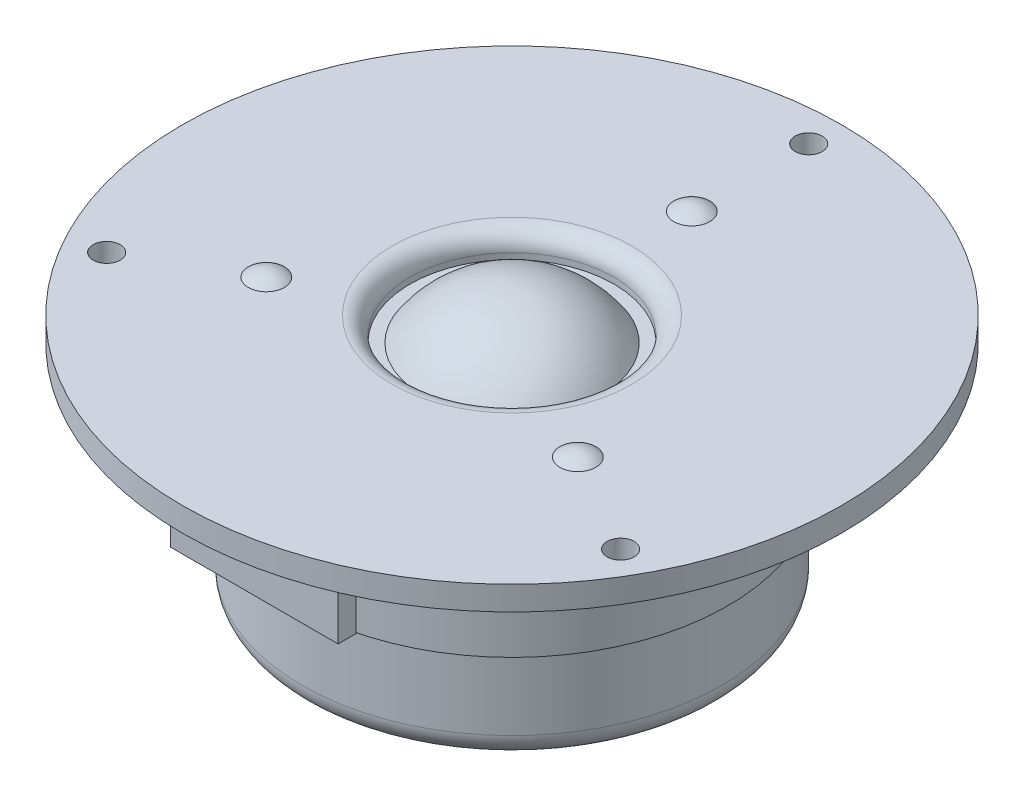
ISO-10303-21;
HEADER;
FILE_DESCRIPTION(('STEP AP214'),'2;1');
FILE_NAME('part.step','',(''),(''),'','','');
FILE_SCHEMA(('AUTOMOTIVE_DESIGN { 1 0 10303 214 1 1 1 1 }'));
ENDSEC;
DATA;
#1=APPLICATION_CONTEXT('core data for automotive mechanical design processes');
#2=APPLICATION_PROTOCOL_DEFINITION('international standard','automotive_design',2000,#1);
#3=PRODUCT_CONTEXT('',#1,'mechanical');
#4=PRODUCT('Part','Part','',(#3));
#5=PRODUCT_RELATED_PRODUCT_CATEGORY('part','',(#4));
#6=PRODUCT_DEFINITION_FORMATION('','',#4);
#7=PRODUCT_DEFINITION_CONTEXT('part definition',#1,'design');
#8=PRODUCT_DEFINITION('design','',#6,#7);
#9=PRODUCT_DEFINITION_SHAPE('','',#8);
#10=(LENGTH_UNIT() NAMED_UNIT(*) SI_UNIT(.MILLI.,.METRE.));
#11=(NAMED_UNIT(*) PLANE_ANGLE_UNIT() SI_UNIT($,.RADIAN.));
#12=(NAMED_UNIT(*) SI_UNIT($,.STERADIAN.) SOLID_ANGLE_UNIT());
#13=UNCERTAINTY_MEASURE_WITH_UNIT(LENGTH_MEASURE(1.E-05),#10,'distance_accuracy_value','');
#14=(GEOMETRIC_REPRESENTATION_CONTEXT(3) GLOBAL_UNCERTAINTY_ASSIGNED_CONTEXT((#13)) GLOBAL_UNIT_ASSIGNED_CONTEXT((#10,
#11,#12)) REPRESENTATION_CONTEXT('',''));
#15=CARTESIAN_POINT('',(0.,0.,0.));
#16=DIRECTION('',(0.,0.,1.));
#17=DIRECTION('',(1.,0.,0.));
#18=AXIS2_PLACEMENT_3D('',#15,#16,#17);
#19=CARTESIAN_POINT('',(37.,0.,0.));
#20=DIRECTION('',(0.,-1.,0.));
#21=DIRECTION('',(0.,0.,-1.));
#22=AXIS2_PLACEMENT_3D('',#19,#20,#21);
#23=PLANE('',#22);
#24=CARTESIAN_POINT('',(42.8682574873299,0.,24.7499999999996));
#25=DIRECTION('',(0.,-1.,0.));
#26=DIRECTION('',(0.,0.,-1.));
#27=AXIS2_PLACEMENT_3D('',#24,#25,#26);
#28=CIRCLE('',#27,2.25);
#29=CARTESIAN_POINT('',(42.8682574873299,0.,22.4999999999996));
#30=VERTEX_POINT('',#29);
#31=EDGE_CURVE('E121',#30,#30,#28,.T.);
#32=ORIENTED_EDGE('',*,*,#31,.F.);
#33=EDGE_LOOP('',(#32));
#34=FACE_BOUND('',#33,.T.);
#35=CARTESIAN_POINT('',(-42.8682574873296,0.,24.7500000000002));
#36=DIRECTION('',(0.,-1.,0.));
#37=DIRECTION('',(0.,0.,-1.));
#38=AXIS2_PLACEMENT_3D('',#35,#36,#37);
#39=CIRCLE('',#38,2.25);
#40=CARTESIAN_POINT('',(-42.8682574873296,0.,22.5000000000002));
#41=VERTEX_POINT('',#40);
#42=EDGE_CURVE('E127',#41,#41,#39,.T.);
#43=ORIENTED_EDGE('',*,*,#42,.F.);
#44=EDGE_LOOP('',(#43));
#45=FACE_BOUND('',#44,.T.);
#46=CARTESIAN_POINT('',(0.,0.,-49.5));
#47=DIRECTION('',(0.,-1.,0.));
#48=DIRECTION('',(0.,0.,-1.));
#49=AXIS2_PLACEMENT_3D('',#46,#47,#48);
#50=CIRCLE('',#49,2.25);
#51=CARTESIAN_POINT('',(0.,0.,-51.75));
#52=VERTEX_POINT('',#51);
#53=EDGE_CURVE('E136',#52,#52,#50,.T.);
#54=ORIENTED_EDGE('',*,*,#53,.F.);
#55=EDGE_LOOP('',(#54));
#56=FACE_BOUND('',#55,.T.);
#57=CARTESIAN_POINT('',(0.,0.,0.));
#58=DIRECTION('',(0.,-1.,0.));
#59=DIRECTION('',(0.,0.,-1.));
#60=AXIS2_PLACEMENT_3D('',#57,#58,#59);
#61=CIRCLE('',#60,55.);
#62=CARTESIAN_POINT('',(0.,0.,-55.));
#63=VERTEX_POINT('',#62);
#64=EDGE_CURVE('E148',#63,#63,#61,.T.);
#65=ORIENTED_EDGE('',*,*,#64,.T.);
#66=EDGE_LOOP('',(#65));
#67=FACE_BOUND('',#66,.T.);
#68=CARTESIAN_POINT('',(0.,0.,0.));
#69=DIRECTION('',(0.,-1.,0.));
#70=DIRECTION('',(0.,0.,-1.));
#71=AXIS2_PLACEMENT_3D('',#68,#69,#70);
#72=CIRCLE('',#71,37.);
#73=CARTESIAN_POINT('',(0.,0.,-37.));
#74=VERTEX_POINT('',#73);
#75=EDGE_CURVE('E151',#74,#74,#72,.T.);
#76=ORIENTED_EDGE('',*,*,#75,.F.);
#77=EDGE_LOOP('',(#76));
#78=FACE_BOUND('',#77,.T.);
#79=DIRECTION('',(1.,0.,0.));
#80=VECTOR('',#79,1.);
#81=CARTESIAN_POINT('',(-14.,0.,40.));
#82=LINE('',#81,#80);
#83=CARTESIAN_POINT('',(-14.,0.,40.));
#84=VERTEX_POINT('',#83);
#85=CARTESIAN_POINT('',(14.,0.,40.));
#86=VERTEX_POINT('',#85);
#87=EDGE_CURVE('E91',#84,#86,#82,.T.);
#88=ORIENTED_EDGE('',*,*,#87,.F.);
#89=DIRECTION('',(0.,0.,-1.));
#90=VECTOR('',#89,1.);
#91=CARTESIAN_POINT('',(-14.,0.,43.));
#92=LINE('',#91,#90);
#93=CARTESIAN_POINT('',(-14.,0.,43.));
#94=VERTEX_POINT('',#93);
#95=EDGE_CURVE('E102',#94,#84,#92,.T.);
#96=ORIENTED_EDGE('',*,*,#95,.F.);
#97=DIRECTION('',(-1.,0.,0.));
#98=VECTOR('',#97,1.);
#99=CARTESIAN_POINT('',(-14.,0.,43.));
#100=LINE('',#99,#98);
#101=CARTESIAN_POINT('',(14.,0.,43.));
#102=VERTEX_POINT('',#101);
#103=EDGE_CURVE('E72',#102,#94,#100,.T.);
#104=ORIENTED_EDGE('',*,*,#103,.F.);
#105=DIRECTION('',(0.,0.,1.));
#106=VECTOR('',#105,1.);
#107=CARTESIAN_POINT('',(14.,0.,43.));
#108=LINE('',#107,#106);
#109=EDGE_CURVE('E106',#86,#102,#108,.T.);
#110=ORIENTED_EDGE('',*,*,#109,.F.);
#111=EDGE_LOOP('',(#88,#96,#104,#110));
#112=FACE_BOUND('',#111,.T.);
#113=ADVANCED_FACE('F35',(#34,#45,#56,#67,#78,#112),#23,.T.);
#114=CARTESIAN_POINT('',(0.,-36.,0.));
#115=DIRECTION('',(0.,-1.,0.));
#116=DIRECTION('',(0.,0.,-1.));
#117=AXIS2_PLACEMENT_3D('',#114,#115,#116);
#118=PLANE('',#117);
#119=CARTESIAN_POINT('',(0.,-36.,0.));
#120=DIRECTION('',(0.,-1.,0.));
#121=DIRECTION('',(0.,0.,-1.));
#122=AXIS2_PLACEMENT_3D('',#119,#120,#121);
#123=CIRCLE('',#122,31.);
#124=CARTESIAN_POINT('',(0.,-36.,-31.));
#125=VERTEX_POINT('',#124);
#126=EDGE_CURVE('E172',#125,#125,#123,.T.);
#127=ORIENTED_EDGE('',*,*,#126,.T.);
#128=EDGE_LOOP('',(#127));
#129=FACE_BOUND('',#128,.T.);
#130=ADVANCED_FACE('F198',(#129),#118,.T.);
#131=CARTESIAN_POINT('',(0.,0.,0.));
#132=DIRECTION('',(0.,-1.,0.));
#133=DIRECTION('',(0.,0.,-1.));
#134=AXIS2_PLACEMENT_3D('',#131,#132,#133);
#135=CYLINDRICAL_SURFACE('',#134,35.);
#136=CARTESIAN_POINT('',(0.,-32.,0.));
#137=DIRECTION('',(0.,-1.,0.));
#138=DIRECTION('',(0.,0.,-1.));
#139=AXIS2_PLACEMENT_3D('',#136,#137,#138);
#140=CIRCLE('',#139,35.);
#141=CARTESIAN_POINT('',(0.,-32.,-35.));
#142=VERTEX_POINT('',#141);
#143=EDGE_CURVE('E175',#142,#142,#140,.F.);
#144=ORIENTED_EDGE('',*,*,#143,.T.);
#145=EDGE_LOOP('',(#144));
#146=FACE_BOUND('',#145,.T.);
#147=CARTESIAN_POINT('',(0.,-20.,0.));
#148=DIRECTION('',(0.,-1.,0.));
#149=DIRECTION('',(0.,0.,-1.));
#150=AXIS2_PLACEMENT_3D('',#147,#148,#149);
#151=CIRCLE('',#150,35.);
#152=CARTESIAN_POINT('',(0.,-20.,-35.));
#153=VERTEX_POINT('',#152);
#154=EDGE_CURVE('E169',#153,#153,#151,.T.);
#155=ORIENTED_EDGE('',*,*,#154,.T.);
#156=EDGE_LOOP('',(#155));
#157=FACE_BOUND('',#156,.T.);
#158=ADVANCED_FACE('F204',(#146,#157),#135,.T.);
#159=CARTESIAN_POINT('',(35.,-20.,0.));
#160=DIRECTION('',(0.,-1.,0.));
#161=DIRECTION('',(0.,0.,-1.));
#162=AXIS2_PLACEMENT_3D('',#159,#160,#161);
#163=PLANE('',#162);
#164=CARTESIAN_POINT('',(0.,-20.,0.));
#165=DIRECTION('',(0.,-1.,0.));
#166=DIRECTION('',(0.,0.,-1.));
#167=AXIS2_PLACEMENT_3D('',#164,#165,#166);
#168=CIRCLE('',#167,36.);
#169=CARTESIAN_POINT('',(0.,-20.,-36.));
#170=VERTEX_POINT('',#169);
#171=EDGE_CURVE('E166',#170,#170,#168,.T.);
#172=ORIENTED_EDGE('',*,*,#171,.T.);
#173=EDGE_LOOP('',(#172));
#174=FACE_BOUND('',#173,.T.);
#175=ORIENTED_EDGE('',*,*,#154,.F.);
#176=EDGE_LOOP('',(#175));
#177=FACE_BOUND('',#176,.T.);
#178=ADVANCED_FACE('F232',(#174,#177),#163,.T.);
#179=CARTESIAN_POINT('',(0.,0.,0.));
#180=DIRECTION('',(0.,-1.,0.));
#181=DIRECTION('',(0.,0.,-1.));
#182=AXIS2_PLACEMENT_3D('',#179,#180,#181);
#183=CYLINDRICAL_SURFACE('',#182,36.);
#184=CARTESIAN_POINT('',(0.,-8.,0.));
#185=DIRECTION('',(0.,-1.,0.));
#186=DIRECTION('',(0.,0.,-1.));
#187=AXIS2_PLACEMENT_3D('',#184,#185,#186);
#188=CIRCLE('',#187,36.);
#189=CARTESIAN_POINT('',(0.,-8.,-36.));
#190=VERTEX_POINT('',#189);
#191=EDGE_CURVE('E163',#190,#190,#188,.T.);
#192=ORIENTED_EDGE('',*,*,#191,.T.);
#193=EDGE_LOOP('',(#192));
#194=FACE_BOUND('',#193,.T.);
#195=ORIENTED_EDGE('',*,*,#171,.F.);
#196=EDGE_LOOP('',(#195));
#197=FACE_BOUND('',#196,.T.);
#198=ADVANCED_FACE('F228',(#194,#197),#183,.T.);
#199=CARTESIAN_POINT('',(36.,-8.,0.));
#200=DIRECTION('',(0.,1.,0.));
#201=DIRECTION('',(0.,0.,1.));
#202=AXIS2_PLACEMENT_3D('',#199,#200,#201);
#203=PLANE('',#202);
#204=CARTESIAN_POINT('',(0.,-8.,0.));
#205=DIRECTION('',(0.,-1.,0.));
#206=DIRECTION('',(0.,0.,-1.));
#207=AXIS2_PLACEMENT_3D('',#204,#205,#206);
#208=CIRCLE('',#207,35.);
#209=CARTESIAN_POINT('',(0.,-8.,-35.));
#210=VERTEX_POINT('',#209);
#211=EDGE_CURVE('E160',#210,#210,#208,.T.);
#212=ORIENTED_EDGE('',*,*,#211,.T.);
#213=EDGE_LOOP('',(#212));
#214=FACE_BOUND('',#213,.T.);
#215=ORIENTED_EDGE('',*,*,#191,.F.);
#216=EDGE_LOOP('',(#215));
#217=FACE_BOUND('',#216,.T.);
#218=ADVANCED_FACE('F224',(#214,#217),#203,.T.);
#219=CARTESIAN_POINT('',(0.,0.,0.));
#220=DIRECTION('',(0.,-1.,0.));
#221=DIRECTION('',(0.,0.,-1.));
#222=AXIS2_PLACEMENT_3D('',#219,#220,#221);
#223=CYLINDRICAL_SURFACE('',#222,35.);
#224=CARTESIAN_POINT('',(0.,-4.,0.));
#225=DIRECTION('',(0.,-1.,0.));
#226=DIRECTION('',(0.,0.,-1.));
#227=AXIS2_PLACEMENT_3D('',#224,#225,#226);
#228=CIRCLE('',#227,35.);
#229=CARTESIAN_POINT('',(0.,-4.,-35.));
#230=VERTEX_POINT('',#229);
#231=EDGE_CURVE('E157',#230,#230,#228,.T.);
#232=ORIENTED_EDGE('',*,*,#231,.T.);
#233=EDGE_LOOP('',(#232));
#234=FACE_BOUND('',#233,.T.);
#235=ORIENTED_EDGE('',*,*,#211,.F.);
#236=EDGE_LOOP('',(#235));
#237=FACE_BOUND('',#236,.T.);
#238=ADVANCED_FACE('F220',(#234,#237),#223,.T.);
#239=CARTESIAN_POINT('',(35.,-4.,0.));
#240=DIRECTION('',(0.,-1.,0.));
#241=DIRECTION('',(0.,0.,-1.));
#242=AXIS2_PLACEMENT_3D('',#239,#240,#241);
#243=PLANE('',#242);
#244=CARTESIAN_POINT('',(0.,-4.,0.));
#245=DIRECTION('',(0.,-1.,0.));
#246=DIRECTION('',(0.,0.,-1.));
#247=AXIS2_PLACEMENT_3D('',#244,#245,#246);
#248=CIRCLE('',#247,37.);
#249=CARTESIAN_POINT('',(0.,-4.,-37.));
#250=VERTEX_POINT('',#249);
#251=EDGE_CURVE('E154',#250,#250,#248,.T.);
#252=ORIENTED_EDGE('',*,*,#251,.T.);
#253=EDGE_LOOP('',(#252));
#254=FACE_BOUND('',#253,.T.);
#255=ORIENTED_EDGE('',*,*,#231,.F.);
#256=EDGE_LOOP('',(#255));
#257=FACE_BOUND('',#256,.T.);
#258=ADVANCED_FACE('F216',(#254,#257),#243,.T.);
#259=CARTESIAN_POINT('',(0.,0.,0.));
#260=DIRECTION('',(0.,-1.,0.));
#261=DIRECTION('',(0.,0.,-1.));
#262=AXIS2_PLACEMENT_3D('',#259,#260,#261);
#263=CYLINDRICAL_SURFACE('',#262,37.);
#264=ORIENTED_EDGE('',*,*,#75,.T.);
#265=EDGE_LOOP('',(#264));
#266=FACE_BOUND('',#265,.T.);
#267=ORIENTED_EDGE('',*,*,#251,.F.);
#268=EDGE_LOOP('',(#267));
#269=FACE_BOUND('',#268,.T.);
#270=ADVANCED_FACE('F213',(#266,#269),#263,.T.);
#271=CARTESIAN_POINT('',(0.,0.,0.));
#272=DIRECTION('',(0.,-1.,0.));
#273=DIRECTION('',(0.,0.,-1.));
#274=AXIS2_PLACEMENT_3D('',#271,#272,#273);
#275=CYLINDRICAL_SURFACE('',#274,55.);
#276=CARTESIAN_POINT('',(0.,4.,0.));
#277=DIRECTION('',(0.,-1.,0.));
#278=DIRECTION('',(0.,0.,-1.));
#279=AXIS2_PLACEMENT_3D('',#276,#277,#278);
#280=CIRCLE('',#279,55.);
#281=CARTESIAN_POINT('',(0.,4.,-55.));
#282=VERTEX_POINT('',#281);
#283=EDGE_CURVE('E145',#282,#282,#280,.T.);
#284=ORIENTED_EDGE('',*,*,#283,.T.);
#285=EDGE_LOOP('',(#284));
#286=FACE_BOUND('',#285,.T.);
#287=ORIENTED_EDGE('',*,*,#64,.F.);
#288=EDGE_LOOP('',(#287));
#289=FACE_BOUND('',#288,.T.);
#290=ADVANCED_FACE('F211',(#286,#289),#275,.T.);
#291=CARTESIAN_POINT('',(55.,4.,0.));
#292=DIRECTION('',(0.,1.,0.));
#293=DIRECTION('',(0.,0.,1.));
#294=AXIS2_PLACEMENT_3D('',#291,#292,#293);
#295=PLANE('',#294);
#296=CARTESIAN_POINT('',(25.9807621135333,4.,14.9999999999998));
#297=DIRECTION('',(0.,1.,0.));
#298=DIRECTION('',(-0.866025403784443,0.,-0.499999999999992));
#299=AXIS2_PLACEMENT_3D('',#296,#297,#298);
#300=CIRCLE('',#299,3.);
#301=CARTESIAN_POINT('',(23.38268590218,4.,13.4999999999998));
#302=VERTEX_POINT('',#301);
#303=EDGE_CURVE('E112',#302,#302,#300,.T.);
#304=ORIENTED_EDGE('',*,*,#303,.F.);
#305=EDGE_LOOP('',(#304));
#306=FACE_BOUND('',#305,.T.);
#307=CARTESIAN_POINT('',(-25.9807621135331,4.,15.0000000000001));
#308=DIRECTION('',(0.,1.,0.));
#309=DIRECTION('',(0.866025403784436,0.,-0.500000000000004));
#310=AXIS2_PLACEMENT_3D('',#307,#308,#309);
#311=CIRCLE('',#310,3.);
#312=CARTESIAN_POINT('',(-23.3826859021798,4.,13.5000000000001));
#313=VERTEX_POINT('',#312);
#314=EDGE_CURVE('E115',#313,#313,#311,.T.);
#315=ORIENTED_EDGE('',*,*,#314,.F.);
#316=EDGE_LOOP('',(#315));
#317=FACE_BOUND('',#316,.T.);
#318=CARTESIAN_POINT('',(42.8682574873299,4.,24.7499999999996));
#319=DIRECTION('',(0.,1.,0.));
#320=DIRECTION('',(0.,0.,1.));
#321=AXIS2_PLACEMENT_3D('',#318,#319,#320);
#322=CIRCLE('',#321,2.25);
#323=CARTESIAN_POINT('',(42.8682574873299,4.,26.9999999999996));
#324=VERTEX_POINT('',#323);
#325=EDGE_CURVE('E118',#324,#324,#322,.T.);
#326=ORIENTED_EDGE('',*,*,#325,.F.);
#327=EDGE_LOOP('',(#326));
#328=FACE_BOUND('',#327,.T.);
#329=CARTESIAN_POINT('',(-42.8682574873296,4.,24.7500000000002));
#330=DIRECTION('',(0.,1.,0.));
#331=DIRECTION('',(0.,0.,1.));
#332=AXIS2_PLACEMENT_3D('',#329,#330,#331);
#333=CIRCLE('',#332,2.25);
#334=CARTESIAN_POINT('',(-42.8682574873296,4.,27.0000000000002));
#335=VERTEX_POINT('',#334);
#336=EDGE_CURVE('E124',#335,#335,#333,.T.);
#337=ORIENTED_EDGE('',*,*,#336,.F.);
#338=EDGE_LOOP('',(#337));
#339=FACE_BOUND('',#338,.T.);
#340=CARTESIAN_POINT('',(0.,4.,-30.));
#341=DIRECTION('',(0.,1.,0.));
#342=DIRECTION('',(0.,0.,1.));
#343=AXIS2_PLACEMENT_3D('',#340,#341,#342);
#344=CIRCLE('',#343,3.);
#345=CARTESIAN_POINT('',(0.,4.,-27.));
#346=VERTEX_POINT('',#345);
#347=EDGE_CURVE('E130',#346,#346,#344,.T.);
#348=ORIENTED_EDGE('',*,*,#347,.F.);
#349=EDGE_LOOP('',(#348));
#350=FACE_BOUND('',#349,.T.);
#351=CARTESIAN_POINT('',(0.,4.,-49.5));
#352=DIRECTION('',(0.,1.,0.));
#353=DIRECTION('',(0.,0.,1.));
#354=AXIS2_PLACEMENT_3D('',#351,#352,#353);
#355=CIRCLE('',#354,2.25);
#356=CARTESIAN_POINT('',(0.,4.,-47.25));
#357=VERTEX_POINT('',#356);
#358=EDGE_CURVE('E133',#357,#357,#355,.T.);
#359=ORIENTED_EDGE('',*,*,#358,.F.);
#360=EDGE_LOOP('',(#359));
#361=FACE_BOUND('',#360,.T.);
#362=CARTESIAN_POINT('',(0.,4.,0.));
#363=DIRECTION('',(0.,1.,0.));
#364=DIRECTION('',(0.,0.,1.));
#365=AXIS2_PLACEMENT_3D('',#362,#363,#364);
#366=CIRCLE('',#365,20.);
#367=CARTESIAN_POINT('',(0.,4.,20.));
#368=VERTEX_POINT('',#367);
#369=EDGE_CURVE('E43',#368,#368,#366,.F.);
#370=ORIENTED_EDGE('',*,*,#369,.T.);
#371=EDGE_LOOP('',(#370));
#372=FACE_BOUND('',#371,.T.);
#373=ORIENTED_EDGE('',*,*,#283,.F.);
#374=EDGE_LOOP('',(#373));
#375=FACE_BOUND('',#374,.T.);
#376=ADVANCED_FACE('F180',(#306,#317,#328,#339,#350,#361,#372,#375),#295,.T.);
#377=CARTESIAN_POINT('',(0.,0.,0.));
#378=DIRECTION('',(0.,-1.,0.));
#379=DIRECTION('',(0.,0.,-1.));
#380=AXIS2_PLACEMENT_3D('',#377,#378,#379);
#381=CYLINDRICAL_SURFACE('',#380,17.);
#382=CARTESIAN_POINT('',(0.,0.999999999999998,0.));
#383=DIRECTION('',(0.,1.,0.));
#384=DIRECTION('',(0.,0.,1.));
#385=AXIS2_PLACEMENT_3D('',#382,#383,#384);
#386=CIRCLE('',#385,17.);
#387=CARTESIAN_POINT('',(0.,0.999999999999998,17.));
#388=VERTEX_POINT('',#387);
#389=EDGE_CURVE('E11',#388,#388,#386,.T.);
#390=ORIENTED_EDGE('',*,*,#389,.T.);
#391=EDGE_LOOP('',(#390));
#392=FACE_BOUND('',#391,.T.);
#393=CARTESIAN_POINT('',(0.,0.,0.));
#394=DIRECTION('',(0.,-1.,0.));
#395=DIRECTION('',(0.,0.,-1.));
#396=AXIS2_PLACEMENT_3D('',#393,#394,#395);
#397=CIRCLE('',#396,17.);
#398=CARTESIAN_POINT('',(0.,0.,-17.));
#399=VERTEX_POINT('',#398);
#400=EDGE_CURVE('E142',#399,#399,#397,.T.);
#401=ORIENTED_EDGE('',*,*,#400,.T.);
#402=EDGE_LOOP('',(#401));
#403=FACE_BOUND('',#402,.T.);
#404=ADVANCED_FACE('F287',(#392,#403),#381,.F.);
#405=CARTESIAN_POINT('',(17.,0.,0.));
#406=DIRECTION('',(0.,1.,0.));
#407=DIRECTION('',(0.,0.,1.));
#408=AXIS2_PLACEMENT_3D('',#405,#406,#407);
#409=PLANE('',#408);
#410=CARTESIAN_POINT('',(0.,0.,0.));
#411=DIRECTION('',(0.,-1.,0.));
#412=DIRECTION('',(0.,0.,-1.));
#413=AXIS2_PLACEMENT_3D('',#410,#411,#412);
#414=CIRCLE('',#413,15.);
#415=CARTESIAN_POINT('',(0.,0.,-15.));
#416=VERTEX_POINT('',#415);
#417=EDGE_CURVE('E139',#416,#416,#414,.T.);
#418=ORIENTED_EDGE('',*,*,#417,.T.);
#419=EDGE_LOOP('',(#418));
#420=FACE_BOUND('',#419,.T.);
#421=ORIENTED_EDGE('',*,*,#400,.F.);
#422=EDGE_LOOP('',(#421));
#423=FACE_BOUND('',#422,.T.);
#424=ADVANCED_FACE('F296',(#420,#423),#409,.T.);
#425=CARTESIAN_POINT('',(0.,-9.9498743710662,0.));
#426=DIRECTION('',(0.,-1.,0.));
#427=DIRECTION('',(1.,0.,0.));
#428=AXIS2_PLACEMENT_3D('',#425,#426,#427);
#429=SPHERICAL_SURFACE('',#428,18.);
#430=ORIENTED_EDGE('',*,*,#417,.F.);
#431=EDGE_LOOP('',(#430));
#432=FACE_BOUND('',#431,.T.);
#433=ADVANCED_FACE('F194',(#432),#429,.T.);
#434=CARTESIAN_POINT('',(0.,-32.,0.));
#435=DIRECTION('',(0.,-1.,0.));
#436=DIRECTION('',(0.,0.,-1.));
#437=AXIS2_PLACEMENT_3D('',#434,#435,#436);
#438=TOROIDAL_SURFACE('',#437,31.,4.);
#439=ORIENTED_EDGE('',*,*,#143,.F.);
#440=EDGE_LOOP('',(#439));
#441=FACE_BOUND('',#440,.T.);
#442=ORIENTED_EDGE('',*,*,#126,.F.);
#443=EDGE_LOOP('',(#442));
#444=FACE_BOUND('',#443,.T.);
#445=ADVANCED_FACE('F185',(#441,#444),#438,.T.);
#446=CARTESIAN_POINT('',(0.,0.999999999999998,0.));
#447=DIRECTION('',(0.,1.,0.));
#448=DIRECTION('',(0.,0.,1.));
#449=AXIS2_PLACEMENT_3D('',#446,#447,#448);
#450=TOROIDAL_SURFACE('',#449,20.,3.);
#451=ORIENTED_EDGE('',*,*,#389,.F.);
#452=EDGE_LOOP('',(#451));
#453=FACE_BOUND('',#452,.T.);
#454=ORIENTED_EDGE('',*,*,#369,.F.);
#455=EDGE_LOOP('',(#454));
#456=FACE_BOUND('',#455,.T.);
#457=ADVANCED_FACE('F37',(#453,#456),#450,.T.);
#458=CARTESIAN_POINT('',(0.,4.,-49.5));
#459=DIRECTION('',(0.,1.,0.));
#460=DIRECTION('',(0.,0.,1.));
#461=AXIS2_PLACEMENT_3D('',#458,#459,#460);
#462=CYLINDRICAL_SURFACE('',#461,2.25);
#463=ORIENTED_EDGE('',*,*,#53,.T.);
#464=EDGE_LOOP('',(#463));
#465=FACE_BOUND('',#464,.T.);
#466=ORIENTED_EDGE('',*,*,#358,.T.);
#467=EDGE_LOOP('',(#466));
#468=FACE_BOUND('',#467,.T.);
#469=ADVANCED_FACE('F184',(#465,#468),#462,.F.);
#470=CARTESIAN_POINT('',(0.,0.,-30.));
#471=DIRECTION('',(0.,1.,0.));
#472=DIRECTION('',(0.,0.,-1.));
#473=AXIS2_PLACEMENT_3D('',#470,#471,#472);
#474=SPHERICAL_SURFACE('',#473,5.00000000000001);
#475=ORIENTED_EDGE('',*,*,#347,.T.);
#476=EDGE_LOOP('',(#475));
#477=FACE_BOUND('',#476,.T.);
#478=ADVANCED_FACE('F191',(#477),#474,.T.);
#479=CARTESIAN_POINT('',(-42.8682574873296,4.,24.7500000000002));
#480=DIRECTION('',(0.,1.,0.));
#481=DIRECTION('',(0.,0.,1.));
#482=AXIS2_PLACEMENT_3D('',#479,#480,#481);
#483=CYLINDRICAL_SURFACE('',#482,2.25);
#484=ORIENTED_EDGE('',*,*,#42,.T.);
#485=EDGE_LOOP('',(#484));
#486=FACE_BOUND('',#485,.T.);
#487=ORIENTED_EDGE('',*,*,#336,.T.);
#488=EDGE_LOOP('',(#487));
#489=FACE_BOUND('',#488,.T.);
#490=ADVANCED_FACE('F334',(#486,#489),#483,.F.);
#491=CARTESIAN_POINT('',(42.8682574873299,4.,24.7499999999996));
#492=DIRECTION('',(0.,1.,0.));
#493=DIRECTION('',(0.,0.,1.));
#494=AXIS2_PLACEMENT_3D('',#491,#492,#493);
#495=CYLINDRICAL_SURFACE('',#494,2.25);
#496=ORIENTED_EDGE('',*,*,#31,.T.);
#497=EDGE_LOOP('',(#496));
#498=FACE_BOUND('',#497,.T.);
#499=ORIENTED_EDGE('',*,*,#325,.T.);
#500=EDGE_LOOP('',(#499));
#501=FACE_BOUND('',#500,.T.);
#502=ADVANCED_FACE('F342',(#498,#501),#495,.F.);
#503=CARTESIAN_POINT('',(-25.9807621135331,0.,15.0000000000001));
#504=DIRECTION('',(0.,1.,0.));
#505=DIRECTION('',(-0.866025403784436,0.,0.500000000000004));
#506=AXIS2_PLACEMENT_3D('',#503,#504,#505);
#507=SPHERICAL_SURFACE('',#506,5.00000000000001);
#508=ORIENTED_EDGE('',*,*,#314,.T.);
#509=EDGE_LOOP('',(#508));
#510=FACE_BOUND('',#509,.T.);
#511=ADVANCED_FACE('F351',(#510),#507,.T.);
#512=CARTESIAN_POINT('',(25.9807621135333,0.,14.9999999999998));
#513=DIRECTION('',(0.,1.,0.));
#514=DIRECTION('',(0.866025403784443,0.,0.499999999999992));
#515=AXIS2_PLACEMENT_3D('',#512,#513,#514);
#516=SPHERICAL_SURFACE('',#515,5.00000000000001);
#517=ORIENTED_EDGE('',*,*,#303,.T.);
#518=EDGE_LOOP('',(#517));
#519=FACE_BOUND('',#518,.T.);
#520=ADVANCED_FACE('F360',(#519),#516,.T.);
#521=CARTESIAN_POINT('',(-14.,-15.,43.));
#522=DIRECTION('',(1.,0.,0.));
#523=DIRECTION('',(0.,0.,-1.));
#524=AXIS2_PLACEMENT_3D('',#521,#522,#523);
#525=PLANE('',#524);
#526=ORIENTED_EDGE('',*,*,#95,.T.);
#527=DIRECTION('',(0.,1.,0.));
#528=VECTOR('',#527,1.);
#529=CARTESIAN_POINT('',(-14.,-15.,40.));
#530=LINE('',#529,#528);
#531=CARTESIAN_POINT('',(-14.,-15.,40.));
#532=VERTEX_POINT('',#531);
#533=EDGE_CURVE('E94',#532,#84,#530,.T.);
#534=ORIENTED_EDGE('',*,*,#533,.F.);
#535=DIRECTION('',(0.,0.,-1.));
#536=VECTOR('',#535,1.);
#537=CARTESIAN_POINT('',(-14.,-15.,43.));
#538=LINE('',#537,#536);
#539=CARTESIAN_POINT('',(-14.,-15.,43.));
#540=VERTEX_POINT('',#539);
#541=EDGE_CURVE('E84',#540,#532,#538,.T.);
#542=ORIENTED_EDGE('',*,*,#541,.F.);
#543=DIRECTION('',(0.,1.,0.));
#544=VECTOR('',#543,1.);
#545=CARTESIAN_POINT('',(-14.,-15.,43.));
#546=LINE('',#545,#544);
#547=EDGE_CURVE('E98',#540,#94,#546,.T.);
#548=ORIENTED_EDGE('',*,*,#547,.T.);
#549=EDGE_LOOP('',(#526,#534,#542,#548));
#550=FACE_BOUND('',#549,.T.);
#551=ADVANCED_FACE('F369',(#550),#525,.F.);
#552=CARTESIAN_POINT('',(-14.,-15.,40.));
#553=DIRECTION('',(0.,0.,1.));
#554=DIRECTION('',(1.,0.,0.));
#555=AXIS2_PLACEMENT_3D('',#552,#553,#554);
#556=PLANE('',#555);
#557=ORIENTED_EDGE('',*,*,#87,.T.);
#558=DIRECTION('',(0.,1.,0.));
#559=VECTOR('',#558,1.);
#560=CARTESIAN_POINT('',(14.,-15.,40.));
#561=LINE('',#560,#559);
#562=CARTESIAN_POINT('',(14.,-15.,40.));
#563=VERTEX_POINT('',#562);
#564=EDGE_CURVE('E88',#563,#86,#561,.T.);
#565=ORIENTED_EDGE('',*,*,#564,.F.);
#566=DIRECTION('',(1.,0.,0.));
#567=VECTOR('',#566,1.);
#568=CARTESIAN_POINT('',(-14.,-15.,40.));
#569=LINE('',#568,#567);
#570=EDGE_CURVE('E79',#532,#563,#569,.T.);
#571=ORIENTED_EDGE('',*,*,#570,.F.);
#572=ORIENTED_EDGE('',*,*,#533,.T.);
#573=EDGE_LOOP('',(#557,#565,#571,#572));
#574=FACE_BOUND('',#573,.T.);
#575=ADVANCED_FACE('F89',(#574),#556,.F.);
#576=CARTESIAN_POINT('',(14.,-15.,43.));
#577=DIRECTION('',(-1.,0.,0.));
#578=DIRECTION('',(0.,0.,1.));
#579=AXIS2_PLACEMENT_3D('',#576,#577,#578);
#580=PLANE('',#579);
#581=ORIENTED_EDGE('',*,*,#109,.T.);
#582=DIRECTION('',(0.,1.,0.));
#583=VECTOR('',#582,1.);
#584=CARTESIAN_POINT('',(14.,-15.,43.));
#585=LINE('',#584,#583);
#586=CARTESIAN_POINT('',(14.,-15.,43.));
#587=VERTEX_POINT('',#586);
#588=EDGE_CURVE('E50',#587,#102,#585,.T.);
#589=ORIENTED_EDGE('',*,*,#588,.F.);
#590=DIRECTION('',(0.,0.,1.));
#591=VECTOR('',#590,1.);
#592=CARTESIAN_POINT('',(14.,-15.,43.));
#593=LINE('',#592,#591);
#594=EDGE_CURVE('E82',#563,#587,#593,.T.);
#595=ORIENTED_EDGE('',*,*,#594,.F.);
#596=ORIENTED_EDGE('',*,*,#564,.T.);
#597=EDGE_LOOP('',(#581,#589,#595,#596));
#598=FACE_BOUND('',#597,.T.);
#599=ADVANCED_FACE('F96',(#598),#580,.F.);
#600=CARTESIAN_POINT('',(-14.,-15.,43.));
#601=DIRECTION('',(0.,0.,-1.));
#602=DIRECTION('',(-1.,0.,0.));
#603=AXIS2_PLACEMENT_3D('',#600,#601,#602);
#604=PLANE('',#603);
#605=ORIENTED_EDGE('',*,*,#103,.T.);
#606=ORIENTED_EDGE('',*,*,#547,.F.);
#607=DIRECTION('',(-1.,0.,0.));
#608=VECTOR('',#607,1.);
#609=CARTESIAN_POINT('',(-14.,-15.,43.));
#610=LINE('',#609,#608);
#611=EDGE_CURVE('E58',#587,#540,#610,.T.);
#612=ORIENTED_EDGE('',*,*,#611,.F.);
#613=ORIENTED_EDGE('',*,*,#588,.T.);
#614=EDGE_LOOP('',(#605,#606,#612,#613));
#615=FACE_BOUND('',#614,.T.);
#616=ADVANCED_FACE('F397',(#615),#604,.F.);
#617=CARTESIAN_POINT('',(0.,-15.,0.));
#618=DIRECTION('',(0.,-1.,0.));
#619=DIRECTION('',(0.,0.,-1.));
#620=AXIS2_PLACEMENT_3D('',#617,#618,#619);
#621=PLANE('',#620);
#622=ORIENTED_EDGE('',*,*,#541,.T.);
#623=ORIENTED_EDGE('',*,*,#570,.T.);
#624=ORIENTED_EDGE('',*,*,#594,.T.);
#625=ORIENTED_EDGE('',*,*,#611,.T.);
#626=EDGE_LOOP('',(#622,#623,#624,#625));
#627=FACE_BOUND('',#626,.T.);
#628=ADVANCED_FACE('F80',(#627),#621,.T.);
#629=CLOSED_SHELL('',(#113,#130,#158,#178,#198,#218,#238,#258,#270,#290,#376,#404,#424,#433,
#445,#457,#469,#478,#490,#502,#511,#520,#551,#575,#599,#616,#628));
#630=MANIFOLD_SOLID_BREP('B2',#629);
#631=ADVANCED_BREP_SHAPE_REPRESENTATION('',(#18,#630),#14);
#632=SHAPE_DEFINITION_REPRESENTATION(#9,#631);
ENDSEC;
END-ISO-10303-21;
